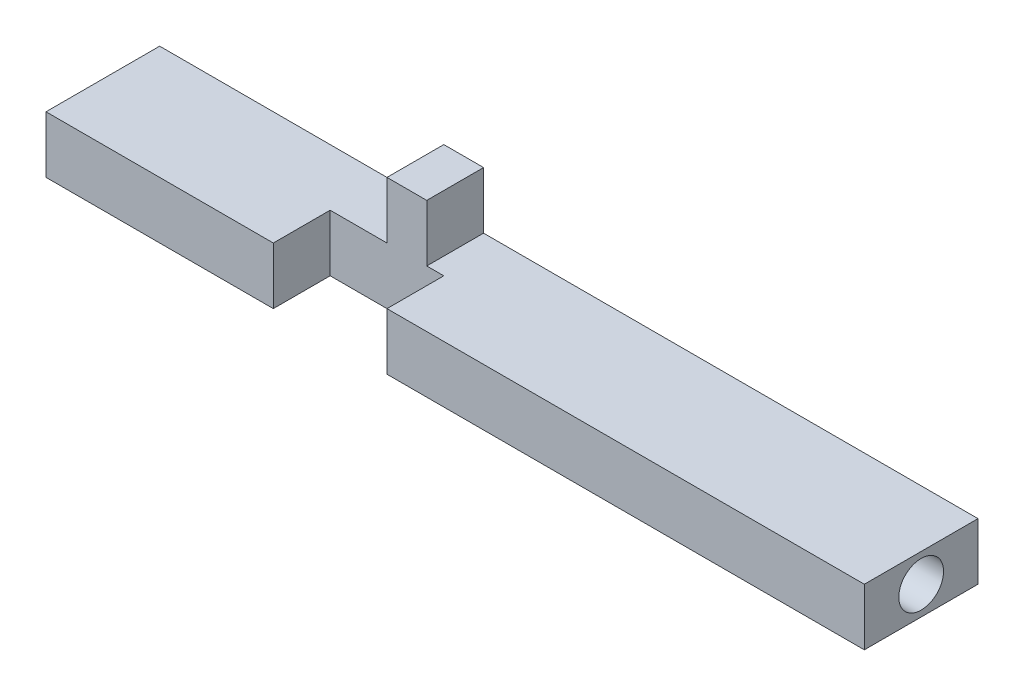
ISO-10303-21;
HEADER;
FILE_DESCRIPTION(('STEP AP214'),'2;1');
FILE_NAME('part.step','',(''),(''),'','','');
FILE_SCHEMA(('AUTOMOTIVE_DESIGN { 1 0 10303 214 1 1 1 1 }'));
ENDSEC;
DATA;
#1=APPLICATION_CONTEXT('core data for automotive mechanical design processes');
#2=APPLICATION_PROTOCOL_DEFINITION('international standard','automotive_design',2000,#1);
#3=PRODUCT_CONTEXT('',#1,'mechanical');
#4=PRODUCT('Part','Part','',(#3));
#5=PRODUCT_RELATED_PRODUCT_CATEGORY('part','',(#4));
#6=PRODUCT_DEFINITION_FORMATION('','',#4);
#7=PRODUCT_DEFINITION_CONTEXT('part definition',#1,'design');
#8=PRODUCT_DEFINITION('design','',#6,#7);
#9=PRODUCT_DEFINITION_SHAPE('','',#8);
#10=(LENGTH_UNIT() NAMED_UNIT(*) SI_UNIT(.MILLI.,.METRE.));
#11=(NAMED_UNIT(*) PLANE_ANGLE_UNIT() SI_UNIT($,.RADIAN.));
#12=(NAMED_UNIT(*) SI_UNIT($,.STERADIAN.) SOLID_ANGLE_UNIT());
#13=UNCERTAINTY_MEASURE_WITH_UNIT(LENGTH_MEASURE(1.E-05),#10,'distance_accuracy_value','');
#14=(GEOMETRIC_REPRESENTATION_CONTEXT(3) GLOBAL_UNCERTAINTY_ASSIGNED_CONTEXT((#13)) GLOBAL_UNIT_ASSIGNED_CONTEXT((#10,
#11,#12)) REPRESENTATION_CONTEXT('',''));
#15=CARTESIAN_POINT('',(0.,0.,0.));
#16=DIRECTION('',(0.,0.,1.));
#17=DIRECTION('',(1.,0.,0.));
#18=AXIS2_PLACEMENT_3D('',#15,#16,#17);
#19=CARTESIAN_POINT('',(0.,1.5875,0.));
#20=DIRECTION('',(0.,-1.,0.));
#21=DIRECTION('',(0.,0.,-1.));
#22=AXIS2_PLACEMENT_3D('',#19,#20,#21);
#23=PLANE('',#22);
#24=DIRECTION('',(0.,0.,1.));
#25=VECTOR('',#24,1.);
#26=CARTESIAN_POINT('',(-6.985,1.5875,0.));
#27=LINE('',#26,#25);
#28=CARTESIAN_POINT('',(-6.985,1.5875,-3.175));
#29=VERTEX_POINT('',#28);
#30=CARTESIAN_POINT('',(-6.985,1.5875,0.));
#31=VERTEX_POINT('',#30);
#32=EDGE_CURVE('E47',#29,#31,#27,.T.);
#33=ORIENTED_EDGE('',*,*,#32,.F.);
#34=DIRECTION('',(-1.,0.,0.));
#35=VECTOR('',#34,1.);
#36=CARTESIAN_POINT('',(-22.86,1.5875,-3.17500000000001));
#37=LINE('',#36,#35);
#38=CARTESIAN_POINT('',(-22.86,1.5875,-3.17500000000001));
#39=VERTEX_POINT('',#38);
#40=EDGE_CURVE('E176',#29,#39,#37,.T.);
#41=ORIENTED_EDGE('',*,*,#40,.T.);
#42=DIRECTION('',(0.,0.,1.));
#43=VECTOR('',#42,1.);
#44=CARTESIAN_POINT('',(-22.86,1.5875,3.17499999999999));
#45=LINE('',#44,#43);
#46=CARTESIAN_POINT('',(-22.86,1.5875,3.17499999999999));
#47=VERTEX_POINT('',#46);
#48=EDGE_CURVE('E180',#39,#47,#45,.T.);
#49=ORIENTED_EDGE('',*,*,#48,.T.);
#50=DIRECTION('',(1.,0.,0.));
#51=VECTOR('',#50,1.);
#52=CARTESIAN_POINT('',(-22.86,1.5875,3.17499999999999));
#53=LINE('',#52,#51);
#54=CARTESIAN_POINT('',(-10.16,1.5875,3.17499999999999));
#55=VERTEX_POINT('',#54);
#56=EDGE_CURVE('E183',#47,#55,#53,.T.);
#57=ORIENTED_EDGE('',*,*,#56,.T.);
#58=DIRECTION('',(0.,0.,1.));
#59=VECTOR('',#58,1.);
#60=CARTESIAN_POINT('',(-10.16,1.5875,0.));
#61=LINE('',#60,#59);
#62=CARTESIAN_POINT('',(-10.16,1.5875,0.));
#63=VERTEX_POINT('',#62);
#64=EDGE_CURVE('E169',#63,#55,#61,.T.);
#65=ORIENTED_EDGE('',*,*,#64,.F.);
#66=DIRECTION('',(-1.,0.,0.));
#67=VECTOR('',#66,1.);
#68=CARTESIAN_POINT('',(-10.16,1.5875,0.));
#69=LINE('',#68,#67);
#70=EDGE_CURVE('E52',#31,#63,#69,.T.);
#71=ORIENTED_EDGE('',*,*,#70,.F.);
#72=EDGE_LOOP('',(#33,#41,#49,#57,#65,#71));
#73=FACE_BOUND('',#72,.T.);
#74=ADVANCED_FACE('F32',(#73),#23,.F.);
#75=DIRECTION('',(0.,0.,-1.));
#76=VECTOR('',#75,1.);
#77=CARTESIAN_POINT('',(-4.7625,1.5875,0.));
#78=LINE('',#77,#76);
#79=CARTESIAN_POINT('',(-4.76250000000001,1.5875,0.));
#80=VERTEX_POINT('',#79);
#81=CARTESIAN_POINT('',(-4.76250000000001,1.5875,-3.175));
#82=VERTEX_POINT('',#81);
#83=EDGE_CURVE('E228',#80,#82,#78,.T.);
#84=ORIENTED_EDGE('',*,*,#83,.F.);
#85=CARTESIAN_POINT('',(-3.81,1.5875,0.));
#86=VERTEX_POINT('',#85);
#87=EDGE_CURVE('E144',#86,#80,#69,.T.);
#88=ORIENTED_EDGE('',*,*,#87,.F.);
#89=DIRECTION('',(0.,0.,1.));
#90=VECTOR('',#89,1.);
#91=CARTESIAN_POINT('',(-3.81,1.5875,0.));
#92=LINE('',#91,#90);
#93=CARTESIAN_POINT('',(-3.81,1.5875,3.17499999999999));
#94=VERTEX_POINT('',#93);
#95=EDGE_CURVE('E160',#86,#94,#92,.T.);
#96=ORIENTED_EDGE('',*,*,#95,.T.);
#97=CARTESIAN_POINT('',(22.86,1.5875,3.17499999999999));
#98=VERTEX_POINT('',#97);
#99=EDGE_CURVE('E182',#94,#98,#53,.T.);
#100=ORIENTED_EDGE('',*,*,#99,.T.);
#101=DIRECTION('',(0.,0.,-1.));
#102=VECTOR('',#101,1.);
#103=CARTESIAN_POINT('',(22.86,1.5875,3.17499999999999));
#104=LINE('',#103,#102);
#105=CARTESIAN_POINT('',(22.86,1.5875,-3.17499999999999));
#106=VERTEX_POINT('',#105);
#107=EDGE_CURVE('E173',#98,#106,#104,.T.);
#108=ORIENTED_EDGE('',*,*,#107,.T.);
#109=EDGE_CURVE('E178',#106,#82,#37,.T.);
#110=ORIENTED_EDGE('',*,*,#109,.T.);
#111=EDGE_LOOP('',(#84,#88,#96,#100,#108,#110));
#112=FACE_BOUND('',#111,.T.);
#113=ADVANCED_FACE('F257',(#112),#23,.F.);
#114=CARTESIAN_POINT('',(-22.86,1.5875,3.17499999999999));
#115=DIRECTION('',(0.,0.,-1.));
#116=DIRECTION('',(-1.,0.,0.));
#117=AXIS2_PLACEMENT_3D('',#114,#115,#116);
#118=PLANE('',#117);
#119=ORIENTED_EDGE('',*,*,#99,.F.);
#120=DIRECTION('',(0.,1.,0.));
#121=VECTOR('',#120,1.);
#122=CARTESIAN_POINT('',(-3.81,-1.5875,3.17499999999999));
#123=LINE('',#122,#121);
#124=CARTESIAN_POINT('',(-3.81,-1.5875,3.17499999999999));
#125=VERTEX_POINT('',#124);
#126=EDGE_CURVE('E145',#125,#94,#123,.T.);
#127=ORIENTED_EDGE('',*,*,#126,.F.);
#128=DIRECTION('',(1.,0.,0.));
#129=VECTOR('',#128,1.);
#130=CARTESIAN_POINT('',(-22.86,-1.5875,3.17499999999999));
#131=LINE('',#130,#129);
#132=CARTESIAN_POINT('',(22.86,-1.5875,3.17499999999999));
#133=VERTEX_POINT('',#132);
#134=EDGE_CURVE('E193',#125,#133,#131,.T.);
#135=ORIENTED_EDGE('',*,*,#134,.T.);
#136=DIRECTION('',(0.,-1.,0.));
#137=VECTOR('',#136,1.);
#138=CARTESIAN_POINT('',(22.86,1.5875,3.17499999999999));
#139=LINE('',#138,#137);
#140=EDGE_CURVE('E186',#98,#133,#139,.T.);
#141=ORIENTED_EDGE('',*,*,#140,.F.);
#142=EDGE_LOOP('',(#119,#127,#135,#141));
#143=FACE_BOUND('',#142,.T.);
#144=ADVANCED_FACE('F262',(#143),#118,.F.);
#145=CARTESIAN_POINT('',(22.86,1.5875,3.17499999999999));
#146=DIRECTION('',(-1.,0.,0.));
#147=DIRECTION('',(0.,0.,1.));
#148=AXIS2_PLACEMENT_3D('',#145,#146,#147);
#149=PLANE('',#148);
#150=CARTESIAN_POINT('',(22.86,0.,0.));
#151=DIRECTION('',(-1.,0.,0.));
#152=DIRECTION('',(0.,0.,1.));
#153=AXIS2_PLACEMENT_3D('',#150,#151,#152);
#154=CIRCLE('',#153,1.25);
#155=CARTESIAN_POINT('',(22.86,0.,1.25));
#156=VERTEX_POINT('',#155);
#157=EDGE_CURVE('E239',#156,#156,#154,.T.);
#158=ORIENTED_EDGE('',*,*,#157,.T.);
#159=EDGE_LOOP('',(#158));
#160=FACE_BOUND('',#159,.T.);
#161=DIRECTION('',(0.,0.,-1.));
#162=VECTOR('',#161,1.);
#163=CARTESIAN_POINT('',(22.86,-1.5875,3.17499999999999));
#164=LINE('',#163,#162);
#165=CARTESIAN_POINT('',(22.86,-1.5875,-3.17499999999999));
#166=VERTEX_POINT('',#165);
#167=EDGE_CURVE('E165',#133,#166,#164,.T.);
#168=ORIENTED_EDGE('',*,*,#167,.T.);
#169=DIRECTION('',(0.,-1.,0.));
#170=VECTOR('',#169,1.);
#171=CARTESIAN_POINT('',(22.86,1.5875,-3.17499999999999));
#172=LINE('',#171,#170);
#173=EDGE_CURVE('E11',#106,#166,#172,.T.);
#174=ORIENTED_EDGE('',*,*,#173,.F.);
#175=ORIENTED_EDGE('',*,*,#107,.F.);
#176=ORIENTED_EDGE('',*,*,#140,.T.);
#177=EDGE_LOOP('',(#168,#174,#175,#176));
#178=FACE_BOUND('',#177,.T.);
#179=ADVANCED_FACE('F34',(#160,#178),#149,.F.);
#180=CARTESIAN_POINT('',(-22.86,1.5875,-3.17500000000001));
#181=DIRECTION('',(0.,0.,1.));
#182=DIRECTION('',(1.,0.,0.));
#183=AXIS2_PLACEMENT_3D('',#180,#181,#182);
#184=PLANE('',#183);
#185=DIRECTION('',(-1.,0.,0.));
#186=VECTOR('',#185,1.);
#187=CARTESIAN_POINT('',(-22.86,-1.5875,-3.17500000000001));
#188=LINE('',#187,#186);
#189=CARTESIAN_POINT('',(-22.86,-1.5875,-3.17500000000001));
#190=VERTEX_POINT('',#189);
#191=EDGE_CURVE('E189',#166,#190,#188,.T.);
#192=ORIENTED_EDGE('',*,*,#191,.T.);
#193=DIRECTION('',(0.,-1.,0.));
#194=VECTOR('',#193,1.);
#195=CARTESIAN_POINT('',(-22.86,1.5875,-3.17500000000001));
#196=LINE('',#195,#194);
#197=EDGE_CURVE('E40',#39,#190,#196,.T.);
#198=ORIENTED_EDGE('',*,*,#197,.F.);
#199=ORIENTED_EDGE('',*,*,#40,.F.);
#200=DIRECTION('',(0.,-1.,0.));
#201=VECTOR('',#200,1.);
#202=CARTESIAN_POINT('',(-6.985,4.7625,-3.175));
#203=LINE('',#202,#201);
#204=CARTESIAN_POINT('',(-6.985,4.7625,-3.175));
#205=VERTEX_POINT('',#204);
#206=EDGE_CURVE('E149',#205,#29,#203,.T.);
#207=ORIENTED_EDGE('',*,*,#206,.F.);
#208=DIRECTION('',(-1.,0.,0.));
#209=VECTOR('',#208,1.);
#210=CARTESIAN_POINT('',(-4.76250000000001,4.7625,-3.175));
#211=LINE('',#210,#209);
#212=CARTESIAN_POINT('',(-4.76250000000001,4.7625,-3.175));
#213=VERTEX_POINT('',#212);
#214=EDGE_CURVE('E129',#213,#205,#211,.T.);
#215=ORIENTED_EDGE('',*,*,#214,.F.);
#216=DIRECTION('',(0.,-1.,0.));
#217=VECTOR('',#216,1.);
#218=CARTESIAN_POINT('',(-4.76250000000001,4.7625,-3.175));
#219=LINE('',#218,#217);
#220=EDGE_CURVE('E126',#213,#82,#219,.T.);
#221=ORIENTED_EDGE('',*,*,#220,.T.);
#222=ORIENTED_EDGE('',*,*,#109,.F.);
#223=ORIENTED_EDGE('',*,*,#173,.T.);
#224=EDGE_LOOP('',(#192,#198,#199,#207,#215,#221,#222,#223));
#225=FACE_BOUND('',#224,.T.);
#226=ADVANCED_FACE('F221',(#225),#184,.F.);
#227=CARTESIAN_POINT('',(-22.86,1.5875,3.17499999999999));
#228=DIRECTION('',(1.,0.,0.));
#229=DIRECTION('',(0.,0.,-1.));
#230=AXIS2_PLACEMENT_3D('',#227,#228,#229);
#231=PLANE('',#230);
#232=CARTESIAN_POINT('',(-22.86,0.,0.));
#233=DIRECTION('',(-1.,0.,0.));
#234=DIRECTION('',(0.,0.,1.));
#235=AXIS2_PLACEMENT_3D('',#232,#233,#234);
#236=CIRCLE('',#235,1.25);
#237=CARTESIAN_POINT('',(-22.86,0.,1.25));
#238=VERTEX_POINT('',#237);
#239=EDGE_CURVE('E233',#238,#238,#236,.T.);
#240=ORIENTED_EDGE('',*,*,#239,.F.);
#241=EDGE_LOOP('',(#240));
#242=FACE_BOUND('',#241,.T.);
#243=DIRECTION('',(0.,0.,1.));
#244=VECTOR('',#243,1.);
#245=CARTESIAN_POINT('',(-22.86,-1.5875,3.17499999999999));
#246=LINE('',#245,#244);
#247=CARTESIAN_POINT('',(-22.86,-1.5875,3.17499999999999));
#248=VERTEX_POINT('',#247);
#249=EDGE_CURVE('E191',#190,#248,#246,.T.);
#250=ORIENTED_EDGE('',*,*,#249,.T.);
#251=DIRECTION('',(0.,-1.,0.));
#252=VECTOR('',#251,1.);
#253=CARTESIAN_POINT('',(-22.86,1.5875,3.17499999999999));
#254=LINE('',#253,#252);
#255=EDGE_CURVE('E198',#47,#248,#254,.T.);
#256=ORIENTED_EDGE('',*,*,#255,.F.);
#257=ORIENTED_EDGE('',*,*,#48,.F.);
#258=ORIENTED_EDGE('',*,*,#197,.T.);
#259=EDGE_LOOP('',(#250,#256,#257,#258));
#260=FACE_BOUND('',#259,.T.);
#261=ADVANCED_FACE('F205',(#242,#260),#231,.F.);
#262=CARTESIAN_POINT('',(-10.16,-1.5875,3.17499999999999));
#263=VERTEX_POINT('',#262);
#264=EDGE_CURVE('E177',#248,#263,#131,.T.);
#265=ORIENTED_EDGE('',*,*,#264,.T.);
#266=DIRECTION('',(0.,-1.,0.));
#267=VECTOR('',#266,1.);
#268=CARTESIAN_POINT('',(-10.16,-1.5875,3.17499999999999));
#269=LINE('',#268,#267);
#270=EDGE_CURVE('E147',#55,#263,#269,.T.);
#271=ORIENTED_EDGE('',*,*,#270,.F.);
#272=ORIENTED_EDGE('',*,*,#56,.F.);
#273=ORIENTED_EDGE('',*,*,#255,.T.);
#274=EDGE_LOOP('',(#265,#271,#272,#273));
#275=FACE_BOUND('',#274,.T.);
#276=ADVANCED_FACE('F217',(#275),#118,.F.);
#277=CARTESIAN_POINT('',(0.,-1.5875,0.));
#278=DIRECTION('',(0.,-1.,0.));
#279=DIRECTION('',(0.,0.,-1.));
#280=AXIS2_PLACEMENT_3D('',#277,#278,#279);
#281=PLANE('',#280);
#282=DIRECTION('',(0.,0.,1.));
#283=VECTOR('',#282,1.);
#284=CARTESIAN_POINT('',(-3.81,-1.5875,0.));
#285=LINE('',#284,#283);
#286=CARTESIAN_POINT('',(-3.81,-1.5875,0.));
#287=VERTEX_POINT('',#286);
#288=EDGE_CURVE('E163',#287,#125,#285,.T.);
#289=ORIENTED_EDGE('',*,*,#288,.F.);
#290=DIRECTION('',(1.,0.,0.));
#291=VECTOR('',#290,1.);
#292=CARTESIAN_POINT('',(-10.16,-1.5875,0.));
#293=LINE('',#292,#291);
#294=CARTESIAN_POINT('',(-10.16,-1.5875,0.));
#295=VERTEX_POINT('',#294);
#296=EDGE_CURVE('E158',#295,#287,#293,.T.);
#297=ORIENTED_EDGE('',*,*,#296,.F.);
#298=DIRECTION('',(0.,0.,1.));
#299=VECTOR('',#298,1.);
#300=CARTESIAN_POINT('',(-10.16,-1.5875,0.));
#301=LINE('',#300,#299);
#302=EDGE_CURVE('E166',#295,#263,#301,.T.);
#303=ORIENTED_EDGE('',*,*,#302,.T.);
#304=ORIENTED_EDGE('',*,*,#264,.F.);
#305=ORIENTED_EDGE('',*,*,#249,.F.);
#306=ORIENTED_EDGE('',*,*,#191,.F.);
#307=ORIENTED_EDGE('',*,*,#167,.F.);
#308=ORIENTED_EDGE('',*,*,#134,.F.);
#309=EDGE_LOOP('',(#289,#297,#303,#304,#305,#306,#307,#308));
#310=FACE_BOUND('',#309,.T.);
#311=ADVANCED_FACE('F211',(#310),#281,.T.);
#312=CARTESIAN_POINT('',(-3.81,-1.5875,0.));
#313=DIRECTION('',(1.,0.,0.));
#314=DIRECTION('',(0.,0.,-1.));
#315=AXIS2_PLACEMENT_3D('',#312,#313,#314);
#316=PLANE('',#315);
#317=ORIENTED_EDGE('',*,*,#126,.T.);
#318=ORIENTED_EDGE('',*,*,#95,.F.);
#319=DIRECTION('',(0.,1.,0.));
#320=VECTOR('',#319,1.);
#321=CARTESIAN_POINT('',(-3.81,-1.5875,0.));
#322=LINE('',#321,#320);
#323=EDGE_CURVE('E153',#287,#86,#322,.T.);
#324=ORIENTED_EDGE('',*,*,#323,.F.);
#325=ORIENTED_EDGE('',*,*,#288,.T.);
#326=EDGE_LOOP('',(#317,#318,#324,#325));
#327=FACE_BOUND('',#326,.T.);
#328=ADVANCED_FACE('F266',(#327),#316,.F.);
#329=CARTESIAN_POINT('',(-10.16,-1.5875,0.));
#330=DIRECTION('',(-1.,0.,0.));
#331=DIRECTION('',(0.,0.,1.));
#332=AXIS2_PLACEMENT_3D('',#329,#330,#331);
#333=PLANE('',#332);
#334=ORIENTED_EDGE('',*,*,#270,.T.);
#335=ORIENTED_EDGE('',*,*,#302,.F.);
#336=DIRECTION('',(0.,-1.,0.));
#337=VECTOR('',#336,1.);
#338=CARTESIAN_POINT('',(-10.16,-1.5875,0.));
#339=LINE('',#338,#337);
#340=EDGE_CURVE('E156',#63,#295,#339,.T.);
#341=ORIENTED_EDGE('',*,*,#340,.F.);
#342=ORIENTED_EDGE('',*,*,#64,.T.);
#343=EDGE_LOOP('',(#334,#335,#341,#342));
#344=FACE_BOUND('',#343,.T.);
#345=ADVANCED_FACE('F294',(#344),#333,.F.);
#346=CARTESIAN_POINT('',(0.,0.,0.));
#347=DIRECTION('',(0.,0.,-1.));
#348=DIRECTION('',(-1.,0.,0.));
#349=AXIS2_PLACEMENT_3D('',#346,#347,#348);
#350=PLANE('',#349);
#351=ORIENTED_EDGE('',*,*,#323,.T.);
#352=ORIENTED_EDGE('',*,*,#87,.T.);
#353=DIRECTION('',(0.,-1.,0.));
#354=VECTOR('',#353,1.);
#355=CARTESIAN_POINT('',(-4.7625,4.7625,0.));
#356=LINE('',#355,#354);
#357=CARTESIAN_POINT('',(-4.7625,4.7625,0.));
#358=VERTEX_POINT('',#357);
#359=EDGE_CURVE('E124',#358,#80,#356,.T.);
#360=ORIENTED_EDGE('',*,*,#359,.F.);
#361=DIRECTION('',(1.,0.,0.));
#362=VECTOR('',#361,1.);
#363=CARTESIAN_POINT('',(-6.985,4.7625,0.));
#364=LINE('',#363,#362);
#365=CARTESIAN_POINT('',(-6.985,4.7625,0.));
#366=VERTEX_POINT('',#365);
#367=EDGE_CURVE('E130',#366,#358,#364,.T.);
#368=ORIENTED_EDGE('',*,*,#367,.F.);
#369=DIRECTION('',(0.,-1.,0.));
#370=VECTOR('',#369,1.);
#371=CARTESIAN_POINT('',(-6.985,4.7625,0.));
#372=LINE('',#371,#370);
#373=EDGE_CURVE('E224',#366,#31,#372,.T.);
#374=ORIENTED_EDGE('',*,*,#373,.T.);
#375=ORIENTED_EDGE('',*,*,#70,.T.);
#376=ORIENTED_EDGE('',*,*,#340,.T.);
#377=ORIENTED_EDGE('',*,*,#296,.T.);
#378=EDGE_LOOP('',(#351,#352,#360,#368,#374,#375,#376,#377));
#379=FACE_BOUND('',#378,.T.);
#380=ADVANCED_FACE('F142',(#379),#350,.F.);
#381=CARTESIAN_POINT('',(-4.7625,4.7625,0.));
#382=DIRECTION('',(-1.,0.,0.));
#383=DIRECTION('',(0.,0.,1.));
#384=AXIS2_PLACEMENT_3D('',#381,#382,#383);
#385=PLANE('',#384);
#386=ORIENTED_EDGE('',*,*,#83,.T.);
#387=ORIENTED_EDGE('',*,*,#220,.F.);
#388=DIRECTION('',(0.,0.,-1.));
#389=VECTOR('',#388,1.);
#390=CARTESIAN_POINT('',(-4.7625,4.7625,0.));
#391=LINE('',#390,#389);
#392=EDGE_CURVE('E119',#358,#213,#391,.T.);
#393=ORIENTED_EDGE('',*,*,#392,.F.);
#394=ORIENTED_EDGE('',*,*,#359,.T.);
#395=EDGE_LOOP('',(#386,#387,#393,#394));
#396=FACE_BOUND('',#395,.T.);
#397=ADVANCED_FACE('F122',(#396),#385,.F.);
#398=CARTESIAN_POINT('',(-6.985,4.7625,0.));
#399=DIRECTION('',(1.,0.,0.));
#400=DIRECTION('',(0.,0.,-1.));
#401=AXIS2_PLACEMENT_3D('',#398,#399,#400);
#402=PLANE('',#401);
#403=ORIENTED_EDGE('',*,*,#32,.T.);
#404=ORIENTED_EDGE('',*,*,#373,.F.);
#405=DIRECTION('',(0.,0.,1.));
#406=VECTOR('',#405,1.);
#407=CARTESIAN_POINT('',(-6.985,4.7625,0.));
#408=LINE('',#407,#406);
#409=EDGE_CURVE('E135',#205,#366,#408,.T.);
#410=ORIENTED_EDGE('',*,*,#409,.F.);
#411=ORIENTED_EDGE('',*,*,#206,.T.);
#412=EDGE_LOOP('',(#403,#404,#410,#411));
#413=FACE_BOUND('',#412,.T.);
#414=ADVANCED_FACE('F223',(#413),#402,.F.);
#415=CARTESIAN_POINT('',(0.,4.7625,0.));
#416=DIRECTION('',(0.,1.,0.));
#417=DIRECTION('',(0.,0.,1.));
#418=AXIS2_PLACEMENT_3D('',#415,#416,#417);
#419=PLANE('',#418);
#420=ORIENTED_EDGE('',*,*,#367,.T.);
#421=ORIENTED_EDGE('',*,*,#392,.T.);
#422=ORIENTED_EDGE('',*,*,#214,.T.);
#423=ORIENTED_EDGE('',*,*,#409,.T.);
#424=EDGE_LOOP('',(#420,#421,#422,#423));
#425=FACE_BOUND('',#424,.T.);
#426=ADVANCED_FACE('F133',(#425),#419,.T.);
#427=CARTESIAN_POINT('',(-15.875,0.,0.));
#428=DIRECTION('',(-1.,0.,0.));
#429=DIRECTION('',(0.,0.,1.));
#430=AXIS2_PLACEMENT_3D('',#427,#428,#429);
#431=CYLINDRICAL_SURFACE('',#430,1.25);
#432=CARTESIAN_POINT('',(-15.875,0.,0.));
#433=DIRECTION('',(-1.,0.,0.));
#434=DIRECTION('',(0.,0.,1.));
#435=AXIS2_PLACEMENT_3D('',#432,#433,#434);
#436=CIRCLE('',#435,1.25);
#437=CARTESIAN_POINT('',(-15.875,0.,1.25));
#438=VERTEX_POINT('',#437);
#439=EDGE_CURVE('E230',#438,#438,#436,.T.);
#440=ORIENTED_EDGE('',*,*,#439,.F.);
#441=EDGE_LOOP('',(#440));
#442=FACE_BOUND('',#441,.T.);
#443=ORIENTED_EDGE('',*,*,#239,.T.);
#444=EDGE_LOOP('',(#443));
#445=FACE_BOUND('',#444,.T.);
#446=ADVANCED_FACE('F308',(#442,#445),#431,.F.);
#447=CARTESIAN_POINT('',(-15.875,0.,0.));
#448=DIRECTION('',(-1.,0.,0.));
#449=DIRECTION('',(0.,0.,1.));
#450=AXIS2_PLACEMENT_3D('',#447,#448,#449);
#451=PLANE('',#450);
#452=ORIENTED_EDGE('',*,*,#439,.T.);
#453=EDGE_LOOP('',(#452));
#454=FACE_BOUND('',#453,.T.);
#455=ADVANCED_FACE('F254',(#454),#451,.T.);
#456=CARTESIAN_POINT('',(15.875,0.,0.));
#457=DIRECTION('',(1.,0.,0.));
#458=DIRECTION('',(0.,0.,-1.));
#459=AXIS2_PLACEMENT_3D('',#456,#457,#458);
#460=CYLINDRICAL_SURFACE('',#459,1.25);
#461=CARTESIAN_POINT('',(15.875,0.,0.));
#462=DIRECTION('',(-1.,0.,0.));
#463=DIRECTION('',(0.,0.,1.));
#464=AXIS2_PLACEMENT_3D('',#461,#462,#463);
#465=CIRCLE('',#464,1.25);
#466=CARTESIAN_POINT('',(15.875,0.,1.25));
#467=VERTEX_POINT('',#466);
#468=EDGE_CURVE('E236',#467,#467,#465,.T.);
#469=ORIENTED_EDGE('',*,*,#468,.T.);
#470=EDGE_LOOP('',(#469));
#471=FACE_BOUND('',#470,.T.);
#472=ORIENTED_EDGE('',*,*,#157,.F.);
#473=EDGE_LOOP('',(#472));
#474=FACE_BOUND('',#473,.T.);
#475=ADVANCED_FACE('F245',(#471,#474),#460,.F.);
#476=CARTESIAN_POINT('',(15.875,0.,0.));
#477=DIRECTION('',(1.,0.,0.));
#478=DIRECTION('',(0.,0.,1.));
#479=AXIS2_PLACEMENT_3D('',#476,#477,#478);
#480=PLANE('',#479);
#481=ORIENTED_EDGE('',*,*,#468,.F.);
#482=EDGE_LOOP('',(#481));
#483=FACE_BOUND('',#482,.T.);
#484=ADVANCED_FACE('F248',(#483),#480,.T.);
#485=CLOSED_SHELL('',(#74,#113,#144,#179,#226,#261,#276,#311,#328,#345,#380,#397,#414,#426,#446,
#455,#475,#484));
#486=MANIFOLD_SOLID_BREP('B2',#485);
#487=ADVANCED_BREP_SHAPE_REPRESENTATION('',(#18,#486),#14);
#488=SHAPE_DEFINITION_REPRESENTATION(#9,#487);
ENDSEC;
END-ISO-10303-21;
